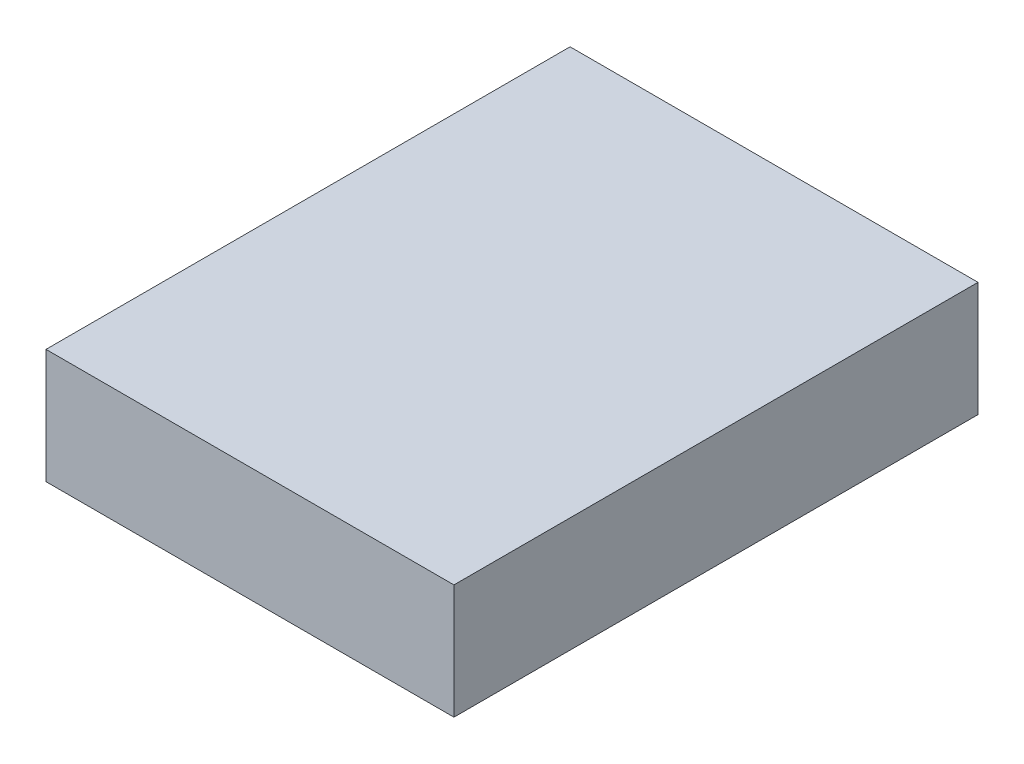
ISO-10303-21;
HEADER;
FILE_DESCRIPTION(('STEP AP214'),'2;1');
FILE_NAME('part.step','',(''),(''),'','','');
FILE_SCHEMA(('AUTOMOTIVE_DESIGN { 1 0 10303 214 1 1 1 1 }'));
ENDSEC;
DATA;
#1=APPLICATION_CONTEXT('core data for automotive mechanical design processes');
#2=APPLICATION_PROTOCOL_DEFINITION('international standard','automotive_design',2000,#1);
#3=PRODUCT_CONTEXT('',#1,'mechanical');
#4=PRODUCT('Part','Part','',(#3));
#5=PRODUCT_RELATED_PRODUCT_CATEGORY('part','',(#4));
#6=PRODUCT_DEFINITION_FORMATION('','',#4);
#7=PRODUCT_DEFINITION_CONTEXT('part definition',#1,'design');
#8=PRODUCT_DEFINITION('design','',#6,#7);
#9=PRODUCT_DEFINITION_SHAPE('','',#8);
#10=(LENGTH_UNIT() NAMED_UNIT(*) SI_UNIT(.MILLI.,.METRE.));
#11=(NAMED_UNIT(*) PLANE_ANGLE_UNIT() SI_UNIT($,.RADIAN.));
#12=(NAMED_UNIT(*) SI_UNIT($,.STERADIAN.) SOLID_ANGLE_UNIT());
#13=UNCERTAINTY_MEASURE_WITH_UNIT(LENGTH_MEASURE(1.E-05),#10,'distance_accuracy_value','');
#14=(GEOMETRIC_REPRESENTATION_CONTEXT(3) GLOBAL_UNCERTAINTY_ASSIGNED_CONTEXT((#13)) GLOBAL_UNIT_ASSIGNED_CONTEXT((#10,
#11,#12)) REPRESENTATION_CONTEXT('',''));
#15=CARTESIAN_POINT('',(0.,0.,0.));
#16=DIRECTION('',(0.,0.,1.));
#17=DIRECTION('',(1.,0.,0.));
#18=AXIS2_PLACEMENT_3D('',#15,#16,#17);
#19=CARTESIAN_POINT('',(-26.7,15.,-34.3));
#20=DIRECTION('',(1.,0.,0.));
#21=DIRECTION('',(0.,0.,-1.));
#22=AXIS2_PLACEMENT_3D('',#19,#20,#21);
#23=PLANE('',#22);
#24=DIRECTION('',(0.,0.,1.));
#25=VECTOR('',#24,1.);
#26=CARTESIAN_POINT('',(-26.7,0.,-34.3));
#27=LINE('',#26,#25);
#28=CARTESIAN_POINT('',(-26.7,0.,-34.3));
#29=VERTEX_POINT('',#28);
#30=CARTESIAN_POINT('',(-26.7,0.,34.3));
#31=VERTEX_POINT('',#30);
#32=EDGE_CURVE('E100',#29,#31,#27,.T.);
#33=ORIENTED_EDGE('',*,*,#32,.T.);
#34=DIRECTION('',(0.,-1.,0.));
#35=VECTOR('',#34,1.);
#36=CARTESIAN_POINT('',(-26.7,15.,34.3));
#37=LINE('',#36,#35);
#38=CARTESIAN_POINT('',(-26.7,15.,34.3));
#39=VERTEX_POINT('',#38);
#40=EDGE_CURVE('E11',#39,#31,#37,.T.);
#41=ORIENTED_EDGE('',*,*,#40,.F.);
#42=DIRECTION('',(0.,0.,1.));
#43=VECTOR('',#42,1.);
#44=CARTESIAN_POINT('',(-26.7,15.,-34.3));
#45=LINE('',#44,#43);
#46=CARTESIAN_POINT('',(-26.7,15.,-34.3));
#47=VERTEX_POINT('',#46);
#48=EDGE_CURVE('E88',#47,#39,#45,.T.);
#49=ORIENTED_EDGE('',*,*,#48,.F.);
#50=DIRECTION('',(0.,-1.,0.));
#51=VECTOR('',#50,1.);
#52=CARTESIAN_POINT('',(-26.7,15.,-34.3));
#53=LINE('',#52,#51);
#54=EDGE_CURVE('E96',#47,#29,#53,.T.);
#55=ORIENTED_EDGE('',*,*,#54,.T.);
#56=EDGE_LOOP('',(#33,#41,#49,#55));
#57=FACE_BOUND('',#56,.T.);
#58=ADVANCED_FACE('F37',(#57),#23,.F.);
#59=CARTESIAN_POINT('',(-26.7,15.,34.3));
#60=DIRECTION('',(0.,0.,-1.));
#61=DIRECTION('',(-1.,0.,0.));
#62=AXIS2_PLACEMENT_3D('',#59,#60,#61);
#63=PLANE('',#62);
#64=DIRECTION('',(1.,0.,0.));
#65=VECTOR('',#64,1.);
#66=CARTESIAN_POINT('',(-26.7,0.,34.3));
#67=LINE('',#66,#65);
#68=CARTESIAN_POINT('',(26.7,0.,34.3));
#69=VERTEX_POINT('',#68);
#70=EDGE_CURVE('E92',#31,#69,#67,.T.);
#71=ORIENTED_EDGE('',*,*,#70,.T.);
#72=DIRECTION('',(0.,-1.,0.));
#73=VECTOR('',#72,1.);
#74=CARTESIAN_POINT('',(26.7,15.,34.3));
#75=LINE('',#74,#73);
#76=CARTESIAN_POINT('',(26.7,15.,34.3));
#77=VERTEX_POINT('',#76);
#78=EDGE_CURVE('E45',#77,#69,#75,.T.);
#79=ORIENTED_EDGE('',*,*,#78,.F.);
#80=DIRECTION('',(1.,0.,0.));
#81=VECTOR('',#80,1.);
#82=CARTESIAN_POINT('',(-26.7,15.,34.3));
#83=LINE('',#82,#81);
#84=EDGE_CURVE('E83',#39,#77,#83,.T.);
#85=ORIENTED_EDGE('',*,*,#84,.F.);
#86=ORIENTED_EDGE('',*,*,#40,.T.);
#87=EDGE_LOOP('',(#71,#79,#85,#86));
#88=FACE_BOUND('',#87,.T.);
#89=ADVANCED_FACE('F91',(#88),#63,.F.);
#90=CARTESIAN_POINT('',(26.7,15.,-34.3));
#91=DIRECTION('',(-1.,0.,0.));
#92=DIRECTION('',(0.,0.,1.));
#93=AXIS2_PLACEMENT_3D('',#90,#91,#92);
#94=PLANE('',#93);
#95=DIRECTION('',(0.,0.,-1.));
#96=VECTOR('',#95,1.);
#97=CARTESIAN_POINT('',(26.7,0.,-34.3));
#98=LINE('',#97,#96);
#99=CARTESIAN_POINT('',(26.7,0.,-34.3));
#100=VERTEX_POINT('',#99);
#101=EDGE_CURVE('E70',#69,#100,#98,.T.);
#102=ORIENTED_EDGE('',*,*,#101,.T.);
#103=DIRECTION('',(0.,-1.,0.));
#104=VECTOR('',#103,1.);
#105=CARTESIAN_POINT('',(26.7,15.,-34.3));
#106=LINE('',#105,#104);
#107=CARTESIAN_POINT('',(26.7,15.,-34.3));
#108=VERTEX_POINT('',#107);
#109=EDGE_CURVE('E93',#108,#100,#106,.T.);
#110=ORIENTED_EDGE('',*,*,#109,.F.);
#111=DIRECTION('',(0.,0.,-1.));
#112=VECTOR('',#111,1.);
#113=CARTESIAN_POINT('',(26.7,15.,-34.3));
#114=LINE('',#113,#112);
#115=EDGE_CURVE('E86',#77,#108,#114,.T.);
#116=ORIENTED_EDGE('',*,*,#115,.F.);
#117=ORIENTED_EDGE('',*,*,#78,.T.);
#118=EDGE_LOOP('',(#102,#110,#116,#117));
#119=FACE_BOUND('',#118,.T.);
#120=ADVANCED_FACE('F94',(#119),#94,.F.);
#121=CARTESIAN_POINT('',(-26.7,15.,-34.3));
#122=DIRECTION('',(0.,0.,1.));
#123=DIRECTION('',(1.,0.,0.));
#124=AXIS2_PLACEMENT_3D('',#121,#122,#123);
#125=PLANE('',#124);
#126=DIRECTION('',(-1.,0.,0.));
#127=VECTOR('',#126,1.);
#128=CARTESIAN_POINT('',(-26.7,0.,-34.3));
#129=LINE('',#128,#127);
#130=EDGE_CURVE('E76',#100,#29,#129,.T.);
#131=ORIENTED_EDGE('',*,*,#130,.T.);
#132=ORIENTED_EDGE('',*,*,#54,.F.);
#133=DIRECTION('',(-1.,0.,0.));
#134=VECTOR('',#133,1.);
#135=CARTESIAN_POINT('',(-26.7,15.,-34.3));
#136=LINE('',#135,#134);
#137=EDGE_CURVE('E53',#108,#47,#136,.T.);
#138=ORIENTED_EDGE('',*,*,#137,.F.);
#139=ORIENTED_EDGE('',*,*,#109,.T.);
#140=EDGE_LOOP('',(#131,#132,#138,#139));
#141=FACE_BOUND('',#140,.T.);
#142=ADVANCED_FACE('F107',(#141),#125,.F.);
#143=CARTESIAN_POINT('',(0.,15.,0.));
#144=DIRECTION('',(0.,1.,0.));
#145=DIRECTION('',(0.,0.,1.));
#146=AXIS2_PLACEMENT_3D('',#143,#144,#145);
#147=PLANE('',#146);
#148=ORIENTED_EDGE('',*,*,#48,.T.);
#149=ORIENTED_EDGE('',*,*,#84,.T.);
#150=ORIENTED_EDGE('',*,*,#115,.T.);
#151=ORIENTED_EDGE('',*,*,#137,.T.);
#152=EDGE_LOOP('',(#148,#149,#150,#151));
#153=FACE_BOUND('',#152,.T.);
#154=ADVANCED_FACE('F84',(#153),#147,.T.);
#155=CARTESIAN_POINT('',(0.,0.,0.));
#156=DIRECTION('',(0.,1.,0.));
#157=DIRECTION('',(0.,0.,1.));
#158=AXIS2_PLACEMENT_3D('',#155,#156,#157);
#159=PLANE('',#158);
#160=ORIENTED_EDGE('',*,*,#32,.F.);
#161=ORIENTED_EDGE('',*,*,#130,.F.);
#162=ORIENTED_EDGE('',*,*,#101,.F.);
#163=ORIENTED_EDGE('',*,*,#70,.F.);
#164=EDGE_LOOP('',(#160,#161,#162,#163));
#165=FACE_BOUND('',#164,.T.);
#166=ADVANCED_FACE('F110',(#165),#159,.F.);
#167=CLOSED_SHELL('',(#58,#89,#120,#142,#154,#166));
#168=MANIFOLD_SOLID_BREP('B2',#167);
#169=ADVANCED_BREP_SHAPE_REPRESENTATION('',(#18,#168),#14);
#170=SHAPE_DEFINITION_REPRESENTATION(#9,#169);
ENDSEC;
END-ISO-10303-21;
